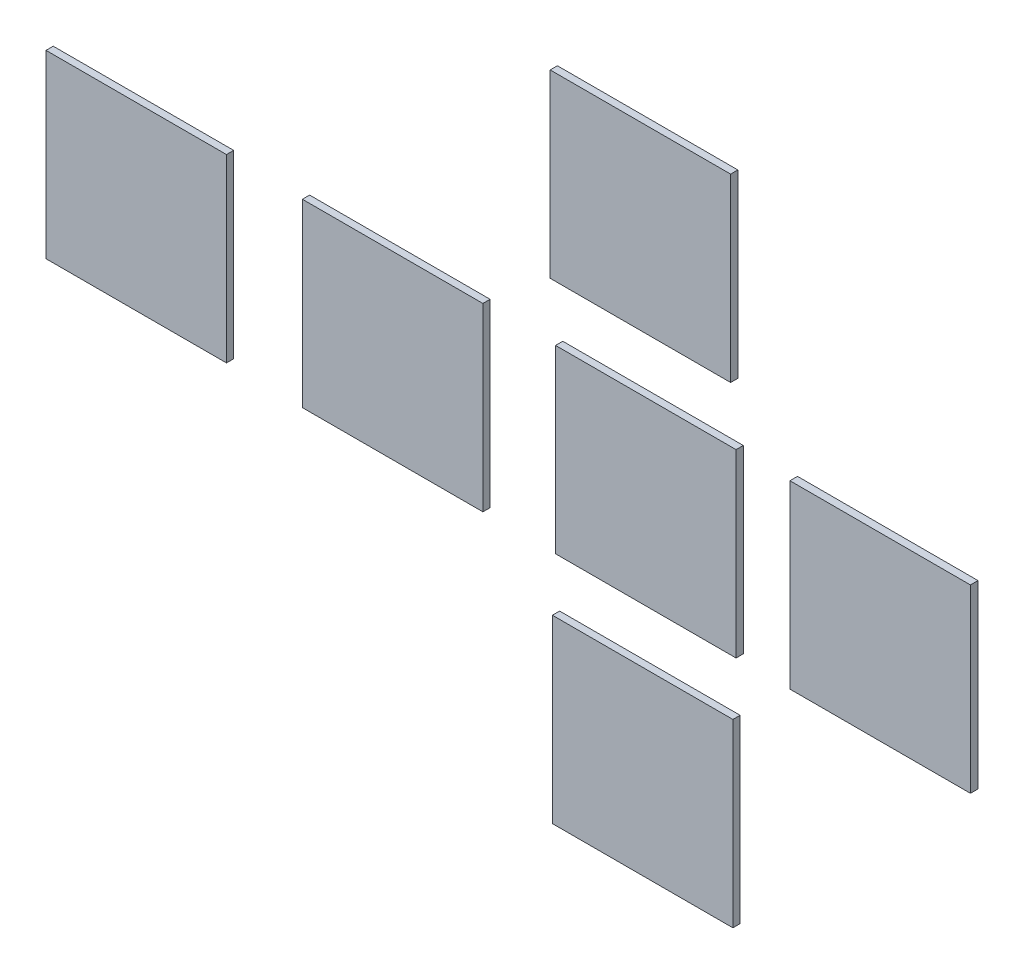
ISO-10303-21;
HEADER;
FILE_DESCRIPTION(('STEP AP214'),'2;1');
FILE_NAME('part.step','',(''),(''),'','','');
FILE_SCHEMA(('AUTOMOTIVE_DESIGN { 1 0 10303 214 1 1 1 1 }'));
ENDSEC;
DATA;
#1=APPLICATION_CONTEXT('core data for automotive mechanical design processes');
#2=APPLICATION_PROTOCOL_DEFINITION('international standard','automotive_design',2000,#1);
#3=PRODUCT_CONTEXT('',#1,'mechanical');
#4=PRODUCT('Part','Part','',(#3));
#5=PRODUCT_RELATED_PRODUCT_CATEGORY('part','',(#4));
#6=PRODUCT_DEFINITION_FORMATION('','',#4);
#7=PRODUCT_DEFINITION_CONTEXT('part definition',#1,'design');
#8=PRODUCT_DEFINITION('design','',#6,#7);
#9=PRODUCT_DEFINITION_SHAPE('','',#8);
#10=(LENGTH_UNIT() NAMED_UNIT(*) SI_UNIT(.MILLI.,.METRE.));
#11=(NAMED_UNIT(*) PLANE_ANGLE_UNIT() SI_UNIT($,.RADIAN.));
#12=(NAMED_UNIT(*) SI_UNIT($,.STERADIAN.) SOLID_ANGLE_UNIT());
#13=UNCERTAINTY_MEASURE_WITH_UNIT(LENGTH_MEASURE(1.E-05),#10,'distance_accuracy_value','');
#14=(GEOMETRIC_REPRESENTATION_CONTEXT(3) GLOBAL_UNCERTAINTY_ASSIGNED_CONTEXT((#13)) GLOBAL_UNIT_ASSIGNED_CONTEXT((#10,
#11,#12)) REPRESENTATION_CONTEXT('',''));
#15=CARTESIAN_POINT('',(0.,0.,0.));
#16=DIRECTION('',(0.,0.,1.));
#17=DIRECTION('',(1.,0.,0.));
#18=AXIS2_PLACEMENT_3D('',#15,#16,#17);
#19=CARTESIAN_POINT('',(-908.036665944506,-901.704073477175,20.));
#20=DIRECTION('',(-1.,0.,0.));
#21=DIRECTION('',(0.,0.,1.));
#22=AXIS2_PLACEMENT_3D('',#19,#20,#21);
#23=PLANE('',#22);
#24=DIRECTION('',(0.,1.,0.));
#25=VECTOR('',#24,1.);
#26=CARTESIAN_POINT('',(-908.036665944506,-901.704073477175,0.));
#27=LINE('',#26,#25);
#28=CARTESIAN_POINT('',(-908.036665944506,-901.704073477175,0.));
#29=VERTEX_POINT('',#28);
#30=CARTESIAN_POINT('',(-908.036665944506,-401.704073477175,0.));
#31=VERTEX_POINT('',#30);
#32=EDGE_CURVE('E12',#29,#31,#27,.T.);
#33=ORIENTED_EDGE('',*,*,#32,.F.);
#34=DIRECTION('',(0.,0.,-1.));
#35=VECTOR('',#34,1.);
#36=CARTESIAN_POINT('',(-908.036665944506,-901.704073477175,20.));
#37=LINE('',#36,#35);
#38=CARTESIAN_POINT('',(-908.036665944506,-901.704073477175,20.));
#39=VERTEX_POINT('',#38);
#40=EDGE_CURVE('E95',#39,#29,#37,.T.);
#41=ORIENTED_EDGE('',*,*,#40,.F.);
#42=DIRECTION('',(0.,1.,0.));
#43=VECTOR('',#42,1.);
#44=CARTESIAN_POINT('',(-908.036665944506,-901.704073477175,20.));
#45=LINE('',#44,#43);
#46=CARTESIAN_POINT('',(-908.036665944506,-401.704073477175,20.));
#47=VERTEX_POINT('',#46);
#48=EDGE_CURVE('E53',#39,#47,#45,.T.);
#49=ORIENTED_EDGE('',*,*,#48,.T.);
#50=DIRECTION('',(0.,0.,-1.));
#51=VECTOR('',#50,1.);
#52=CARTESIAN_POINT('',(-908.036665944506,-401.704073477175,20.));
#53=LINE('',#52,#51);
#54=EDGE_CURVE('E68',#47,#31,#53,.T.);
#55=ORIENTED_EDGE('',*,*,#54,.T.);
#56=EDGE_LOOP('',(#33,#41,#49,#55));
#57=FACE_BOUND('',#56,.T.);
#58=ADVANCED_FACE('F49',(#57),#23,.T.);
#59=CARTESIAN_POINT('',(-908.036665944506,-901.704073477175,20.));
#60=DIRECTION('',(0.,1.,0.));
#61=DIRECTION('',(0.,0.,1.));
#62=AXIS2_PLACEMENT_3D('',#59,#60,#61);
#63=PLANE('',#62);
#64=DIRECTION('',(1.,0.,0.));
#65=VECTOR('',#64,1.);
#66=CARTESIAN_POINT('',(-908.036665944506,-901.704073477175,0.));
#67=LINE('',#66,#65);
#68=CARTESIAN_POINT('',(-408.036665944506,-901.704073477175,0.));
#69=VERTEX_POINT('',#68);
#70=EDGE_CURVE('E98',#29,#69,#67,.T.);
#71=ORIENTED_EDGE('',*,*,#70,.T.);
#72=DIRECTION('',(0.,0.,-1.));
#73=VECTOR('',#72,1.);
#74=CARTESIAN_POINT('',(-408.036665944506,-901.704073477175,20.));
#75=LINE('',#74,#73);
#76=CARTESIAN_POINT('',(-408.036665944506,-901.704073477175,20.));
#77=VERTEX_POINT('',#76);
#78=EDGE_CURVE('E101',#77,#69,#75,.T.);
#79=ORIENTED_EDGE('',*,*,#78,.F.);
#80=DIRECTION('',(1.,0.,0.));
#81=VECTOR('',#80,1.);
#82=CARTESIAN_POINT('',(-908.036665944506,-901.704073477175,20.));
#83=LINE('',#82,#81);
#84=EDGE_CURVE('E117',#39,#77,#83,.T.);
#85=ORIENTED_EDGE('',*,*,#84,.F.);
#86=ORIENTED_EDGE('',*,*,#40,.T.);
#87=EDGE_LOOP('',(#71,#79,#85,#86));
#88=FACE_BOUND('',#87,.T.);
#89=ADVANCED_FACE('F100',(#88),#63,.F.);
#90=CARTESIAN_POINT('',(-408.036665944506,-901.704073477175,20.));
#91=DIRECTION('',(-1.,0.,0.));
#92=DIRECTION('',(0.,0.,1.));
#93=AXIS2_PLACEMENT_3D('',#90,#91,#92);
#94=PLANE('',#93);
#95=DIRECTION('',(0.,1.,0.));
#96=VECTOR('',#95,1.);
#97=CARTESIAN_POINT('',(-408.036665944506,-901.704073477175,0.));
#98=LINE('',#97,#96);
#99=CARTESIAN_POINT('',(-408.036665944506,-401.704073477175,0.));
#100=VERTEX_POINT('',#99);
#101=EDGE_CURVE('E104',#69,#100,#98,.T.);
#102=ORIENTED_EDGE('',*,*,#101,.T.);
#103=DIRECTION('',(0.,0.,-1.));
#104=VECTOR('',#103,1.);
#105=CARTESIAN_POINT('',(-408.036665944506,-401.704073477175,20.));
#106=LINE('',#105,#104);
#107=CARTESIAN_POINT('',(-408.036665944506,-401.704073477175,20.));
#108=VERTEX_POINT('',#107);
#109=EDGE_CURVE('E110',#108,#100,#106,.T.);
#110=ORIENTED_EDGE('',*,*,#109,.F.);
#111=DIRECTION('',(0.,1.,0.));
#112=VECTOR('',#111,1.);
#113=CARTESIAN_POINT('',(-408.036665944506,-901.704073477175,20.));
#114=LINE('',#113,#112);
#115=EDGE_CURVE('E85',#77,#108,#114,.T.);
#116=ORIENTED_EDGE('',*,*,#115,.F.);
#117=ORIENTED_EDGE('',*,*,#78,.T.);
#118=EDGE_LOOP('',(#102,#110,#116,#117));
#119=FACE_BOUND('',#118,.T.);
#120=ADVANCED_FACE('F108',(#119),#94,.F.);
#121=CARTESIAN_POINT('',(-908.036665944506,-401.704073477175,20.));
#122=DIRECTION('',(0.,1.,0.));
#123=DIRECTION('',(0.,0.,1.));
#124=AXIS2_PLACEMENT_3D('',#121,#122,#123);
#125=PLANE('',#124);
#126=DIRECTION('',(1.,0.,0.));
#127=VECTOR('',#126,1.);
#128=CARTESIAN_POINT('',(-908.036665944506,-401.704073477175,0.));
#129=LINE('',#128,#127);
#130=EDGE_CURVE('E59',#31,#100,#129,.T.);
#131=ORIENTED_EDGE('',*,*,#130,.F.);
#132=ORIENTED_EDGE('',*,*,#54,.F.);
#133=DIRECTION('',(1.,0.,0.));
#134=VECTOR('',#133,1.);
#135=CARTESIAN_POINT('',(-908.036665944506,-401.704073477175,20.));
#136=LINE('',#135,#134);
#137=EDGE_CURVE('E119',#47,#108,#136,.T.);
#138=ORIENTED_EDGE('',*,*,#137,.T.);
#139=ORIENTED_EDGE('',*,*,#109,.T.);
#140=EDGE_LOOP('',(#131,#132,#138,#139));
#141=FACE_BOUND('',#140,.T.);
#142=ADVANCED_FACE('F122',(#141),#125,.T.);
#143=CARTESIAN_POINT('',(0.,0.,20.));
#144=DIRECTION('',(0.,0.,-1.));
#145=DIRECTION('',(-1.,0.,0.));
#146=AXIS2_PLACEMENT_3D('',#143,#144,#145);
#147=PLANE('',#146);
#148=ORIENTED_EDGE('',*,*,#48,.F.);
#149=ORIENTED_EDGE('',*,*,#84,.T.);
#150=ORIENTED_EDGE('',*,*,#115,.T.);
#151=ORIENTED_EDGE('',*,*,#137,.F.);
#152=EDGE_LOOP('',(#148,#149,#150,#151));
#153=FACE_BOUND('',#152,.T.);
#154=ADVANCED_FACE('F51',(#153),#147,.F.);
#155=CARTESIAN_POINT('',(0.,0.,0.));
#156=DIRECTION('',(0.,0.,-1.));
#157=DIRECTION('',(-1.,0.,0.));
#158=AXIS2_PLACEMENT_3D('',#155,#156,#157);
#159=PLANE('',#158);
#160=ORIENTED_EDGE('',*,*,#32,.T.);
#161=ORIENTED_EDGE('',*,*,#130,.T.);
#162=ORIENTED_EDGE('',*,*,#101,.F.);
#163=ORIENTED_EDGE('',*,*,#70,.F.);
#164=EDGE_LOOP('',(#160,#161,#162,#163));
#165=FACE_BOUND('',#164,.T.);
#166=ADVANCED_FACE('F112',(#165),#159,.T.);
#167=CLOSED_SHELL('',(#58,#89,#120,#142,#154,#166));
#168=MANIFOLD_SOLID_BREP('B2',#167);
#169=CARTESIAN_POINT('',(-1600.64717586164,250.02016349866,20.));
#170=DIRECTION('',(0.,1.,0.));
#171=DIRECTION('',(0.,0.,1.));
#172=AXIS2_PLACEMENT_3D('',#169,#170,#171);
#173=PLANE('',#172);
#174=DIRECTION('',(1.,0.,0.));
#175=VECTOR('',#174,1.);
#176=CARTESIAN_POINT('',(-1600.64717586164,250.02016349866,0.));
#177=LINE('',#176,#175);
#178=CARTESIAN_POINT('',(-1600.64717586164,250.02016349866,0.));
#179=VERTEX_POINT('',#178);
#180=CARTESIAN_POINT('',(-1100.64717586164,250.02016349866,0.));
#181=VERTEX_POINT('',#180);
#182=EDGE_CURVE('E47',#179,#181,#177,.T.);
#183=ORIENTED_EDGE('',*,*,#182,.F.);
#184=DIRECTION('',(0.,0.,-1.));
#185=VECTOR('',#184,1.);
#186=CARTESIAN_POINT('',(-1600.64717586164,250.02016349866,20.));
#187=LINE('',#186,#185);
#188=CARTESIAN_POINT('',(-1600.64717586164,250.02016349866,20.));
#189=VERTEX_POINT('',#188);
#190=EDGE_CURVE('E230',#189,#179,#187,.T.);
#191=ORIENTED_EDGE('',*,*,#190,.F.);
#192=DIRECTION('',(1.,0.,0.));
#193=VECTOR('',#192,1.);
#194=CARTESIAN_POINT('',(-1600.64717586164,250.02016349866,20.));
#195=LINE('',#194,#193);
#196=CARTESIAN_POINT('',(-1100.64717586164,250.02016349866,20.));
#197=VERTEX_POINT('',#196);
#198=EDGE_CURVE('E186',#189,#197,#195,.T.);
#199=ORIENTED_EDGE('',*,*,#198,.T.);
#200=DIRECTION('',(0.,0.,-1.));
#201=VECTOR('',#200,1.);
#202=CARTESIAN_POINT('',(-1100.64717586164,250.02016349866,20.));
#203=LINE('',#202,#201);
#204=EDGE_CURVE('E201',#197,#181,#203,.T.);
#205=ORIENTED_EDGE('',*,*,#204,.T.);
#206=EDGE_LOOP('',(#183,#191,#199,#205));
#207=FACE_BOUND('',#206,.T.);
#208=ADVANCED_FACE('F182',(#207),#173,.T.);
#209=CARTESIAN_POINT('',(-1600.64717586164,-249.97983650134,20.));
#210=DIRECTION('',(-1.,0.,0.));
#211=DIRECTION('',(0.,0.,1.));
#212=AXIS2_PLACEMENT_3D('',#209,#210,#211);
#213=PLANE('',#212);
#214=DIRECTION('',(0.,1.,0.));
#215=VECTOR('',#214,1.);
#216=CARTESIAN_POINT('',(-1600.64717586164,-249.97983650134,0.));
#217=LINE('',#216,#215);
#218=CARTESIAN_POINT('',(-1600.64717586164,-249.97983650134,0.));
#219=VERTEX_POINT('',#218);
#220=EDGE_CURVE('E244',#219,#179,#217,.T.);
#221=ORIENTED_EDGE('',*,*,#220,.F.);
#222=DIRECTION('',(0.,0.,-1.));
#223=VECTOR('',#222,1.);
#224=CARTESIAN_POINT('',(-1600.64717586164,-249.97983650134,20.));
#225=LINE('',#224,#223);
#226=CARTESIAN_POINT('',(-1600.64717586164,-249.97983650134,20.));
#227=VERTEX_POINT('',#226);
#228=EDGE_CURVE('E233',#227,#219,#225,.T.);
#229=ORIENTED_EDGE('',*,*,#228,.F.);
#230=DIRECTION('',(0.,1.,0.));
#231=VECTOR('',#230,1.);
#232=CARTESIAN_POINT('',(-1600.64717586164,-249.97983650134,20.));
#233=LINE('',#232,#231);
#234=EDGE_CURVE('E251',#227,#189,#233,.T.);
#235=ORIENTED_EDGE('',*,*,#234,.T.);
#236=ORIENTED_EDGE('',*,*,#190,.T.);
#237=EDGE_LOOP('',(#221,#229,#235,#236));
#238=FACE_BOUND('',#237,.T.);
#239=ADVANCED_FACE('F246',(#238),#213,.T.);
#240=CARTESIAN_POINT('',(-1600.64717586164,-249.97983650134,20.));
#241=DIRECTION('',(0.,1.,0.));
#242=DIRECTION('',(0.,0.,1.));
#243=AXIS2_PLACEMENT_3D('',#240,#241,#242);
#244=PLANE('',#243);
#245=DIRECTION('',(1.,0.,0.));
#246=VECTOR('',#245,1.);
#247=CARTESIAN_POINT('',(-1600.64717586164,-249.97983650134,0.));
#248=LINE('',#247,#246);
#249=CARTESIAN_POINT('',(-1100.64717586164,-249.97983650134,0.));
#250=VERTEX_POINT('',#249);
#251=EDGE_CURVE('E236',#219,#250,#248,.T.);
#252=ORIENTED_EDGE('',*,*,#251,.T.);
#253=DIRECTION('',(0.,0.,-1.));
#254=VECTOR('',#253,1.);
#255=CARTESIAN_POINT('',(-1100.64717586164,-249.97983650134,20.));
#256=LINE('',#255,#254);
#257=CARTESIAN_POINT('',(-1100.64717586164,-249.97983650134,20.));
#258=VERTEX_POINT('',#257);
#259=EDGE_CURVE('E238',#258,#250,#256,.T.);
#260=ORIENTED_EDGE('',*,*,#259,.F.);
#261=DIRECTION('',(1.,0.,0.));
#262=VECTOR('',#261,1.);
#263=CARTESIAN_POINT('',(-1600.64717586164,-249.97983650134,20.));
#264=LINE('',#263,#262);
#265=EDGE_CURVE('E219',#227,#258,#264,.T.);
#266=ORIENTED_EDGE('',*,*,#265,.F.);
#267=ORIENTED_EDGE('',*,*,#228,.T.);
#268=EDGE_LOOP('',(#252,#260,#266,#267));
#269=FACE_BOUND('',#268,.T.);
#270=ADVANCED_FACE('F235',(#269),#244,.F.);
#271=CARTESIAN_POINT('',(-1100.64717586164,-249.97983650134,20.));
#272=DIRECTION('',(-1.,0.,0.));
#273=DIRECTION('',(0.,0.,1.));
#274=AXIS2_PLACEMENT_3D('',#271,#272,#273);
#275=PLANE('',#274);
#276=DIRECTION('',(0.,1.,0.));
#277=VECTOR('',#276,1.);
#278=CARTESIAN_POINT('',(-1100.64717586164,-249.97983650134,0.));
#279=LINE('',#278,#277);
#280=EDGE_CURVE('E192',#250,#181,#279,.T.);
#281=ORIENTED_EDGE('',*,*,#280,.T.);
#282=ORIENTED_EDGE('',*,*,#204,.F.);
#283=DIRECTION('',(0.,1.,0.));
#284=VECTOR('',#283,1.);
#285=CARTESIAN_POINT('',(-1100.64717586164,-249.97983650134,20.));
#286=LINE('',#285,#284);
#287=EDGE_CURVE('E224',#258,#197,#286,.T.);
#288=ORIENTED_EDGE('',*,*,#287,.F.);
#289=ORIENTED_EDGE('',*,*,#259,.T.);
#290=EDGE_LOOP('',(#281,#282,#288,#289));
#291=FACE_BOUND('',#290,.T.);
#292=ADVANCED_FACE('F256',(#291),#275,.F.);
#293=CARTESIAN_POINT('',(0.,0.,20.));
#294=DIRECTION('',(0.,0.,1.));
#295=DIRECTION('',(1.,0.,0.));
#296=AXIS2_PLACEMENT_3D('',#293,#294,#295);
#297=PLANE('',#296);
#298=ORIENTED_EDGE('',*,*,#198,.F.);
#299=ORIENTED_EDGE('',*,*,#234,.F.);
#300=ORIENTED_EDGE('',*,*,#265,.T.);
#301=ORIENTED_EDGE('',*,*,#287,.T.);
#302=EDGE_LOOP('',(#298,#299,#300,#301));
#303=FACE_BOUND('',#302,.T.);
#304=ADVANCED_FACE('F184',(#303),#297,.T.);
#305=CARTESIAN_POINT('',(0.,0.,0.));
#306=DIRECTION('',(0.,0.,1.));
#307=DIRECTION('',(1.,0.,0.));
#308=AXIS2_PLACEMENT_3D('',#305,#306,#307);
#309=PLANE('',#308);
#310=ORIENTED_EDGE('',*,*,#182,.T.);
#311=ORIENTED_EDGE('',*,*,#280,.F.);
#312=ORIENTED_EDGE('',*,*,#251,.F.);
#313=ORIENTED_EDGE('',*,*,#220,.T.);
#314=EDGE_LOOP('',(#310,#311,#312,#313));
#315=FACE_BOUND('',#314,.T.);
#316=ADVANCED_FACE('F243',(#315),#309,.F.);
#317=CLOSED_SHELL('',(#208,#239,#270,#292,#304,#316));
#318=MANIFOLD_SOLID_BREP('B6',#317);
#319=CARTESIAN_POINT('',(-2310.99861055703,-247.902571651521,20.));
#320=DIRECTION('',(-1.,0.,0.));
#321=DIRECTION('',(0.,0.,1.));
#322=AXIS2_PLACEMENT_3D('',#319,#320,#321);
#323=PLANE('',#322);
#324=DIRECTION('',(0.,1.,0.));
#325=VECTOR('',#324,1.);
#326=CARTESIAN_POINT('',(-2310.99861055703,-247.902571651521,0.));
#327=LINE('',#326,#325);
#328=CARTESIAN_POINT('',(-2310.99861055703,-247.902571651521,0.));
#329=VERTEX_POINT('',#328);
#330=CARTESIAN_POINT('',(-2310.99861055703,252.097428348479,0.));
#331=VERTEX_POINT('',#330);
#332=EDGE_CURVE('E180',#329,#331,#327,.T.);
#333=ORIENTED_EDGE('',*,*,#332,.F.);
#334=DIRECTION('',(0.,0.,-1.));
#335=VECTOR('',#334,1.);
#336=CARTESIAN_POINT('',(-2310.99861055703,-247.902571651521,20.));
#337=LINE('',#336,#335);
#338=CARTESIAN_POINT('',(-2310.99861055703,-247.902571651521,20.));
#339=VERTEX_POINT('',#338);
#340=EDGE_CURVE('E361',#339,#329,#337,.T.);
#341=ORIENTED_EDGE('',*,*,#340,.F.);
#342=DIRECTION('',(0.,1.,0.));
#343=VECTOR('',#342,1.);
#344=CARTESIAN_POINT('',(-2310.99861055703,-247.902571651521,20.));
#345=LINE('',#344,#343);
#346=CARTESIAN_POINT('',(-2310.99861055703,252.097428348479,20.));
#347=VERTEX_POINT('',#346);
#348=EDGE_CURVE('E319',#339,#347,#345,.T.);
#349=ORIENTED_EDGE('',*,*,#348,.T.);
#350=DIRECTION('',(0.,0.,-1.));
#351=VECTOR('',#350,1.);
#352=CARTESIAN_POINT('',(-2310.99861055703,252.097428348479,20.));
#353=LINE('',#352,#351);
#354=EDGE_CURVE('E334',#347,#331,#353,.T.);
#355=ORIENTED_EDGE('',*,*,#354,.T.);
#356=EDGE_LOOP('',(#333,#341,#349,#355));
#357=FACE_BOUND('',#356,.T.);
#358=ADVANCED_FACE('F315',(#357),#323,.T.);
#359=CARTESIAN_POINT('',(-2310.99861055703,-247.902571651521,20.));
#360=DIRECTION('',(0.,1.,0.));
#361=DIRECTION('',(0.,0.,1.));
#362=AXIS2_PLACEMENT_3D('',#359,#360,#361);
#363=PLANE('',#362);
#364=DIRECTION('',(1.,0.,0.));
#365=VECTOR('',#364,1.);
#366=CARTESIAN_POINT('',(-2310.99861055703,-247.902571651521,0.));
#367=LINE('',#366,#365);
#368=CARTESIAN_POINT('',(-1810.99861055703,-247.902571651521,0.));
#369=VERTEX_POINT('',#368);
#370=EDGE_CURVE('E364',#329,#369,#367,.T.);
#371=ORIENTED_EDGE('',*,*,#370,.T.);
#372=DIRECTION('',(0.,0.,-1.));
#373=VECTOR('',#372,1.);
#374=CARTESIAN_POINT('',(-1810.99861055703,-247.902571651521,20.));
#375=LINE('',#374,#373);
#376=CARTESIAN_POINT('',(-1810.99861055703,-247.902571651521,20.));
#377=VERTEX_POINT('',#376);
#378=EDGE_CURVE('E367',#377,#369,#375,.T.);
#379=ORIENTED_EDGE('',*,*,#378,.F.);
#380=DIRECTION('',(1.,0.,0.));
#381=VECTOR('',#380,1.);
#382=CARTESIAN_POINT('',(-2310.99861055703,-247.902571651521,20.));
#383=LINE('',#382,#381);
#384=EDGE_CURVE('E383',#339,#377,#383,.T.);
#385=ORIENTED_EDGE('',*,*,#384,.F.);
#386=ORIENTED_EDGE('',*,*,#340,.T.);
#387=EDGE_LOOP('',(#371,#379,#385,#386));
#388=FACE_BOUND('',#387,.T.);
#389=ADVANCED_FACE('F366',(#388),#363,.F.);
#390=CARTESIAN_POINT('',(-1810.99861055703,-247.902571651521,20.));
#391=DIRECTION('',(-1.,0.,0.));
#392=DIRECTION('',(0.,0.,1.));
#393=AXIS2_PLACEMENT_3D('',#390,#391,#392);
#394=PLANE('',#393);
#395=DIRECTION('',(0.,1.,0.));
#396=VECTOR('',#395,1.);
#397=CARTESIAN_POINT('',(-1810.99861055703,-247.902571651521,0.));
#398=LINE('',#397,#396);
#399=CARTESIAN_POINT('',(-1810.99861055703,252.097428348479,0.));
#400=VERTEX_POINT('',#399);
#401=EDGE_CURVE('E370',#369,#400,#398,.T.);
#402=ORIENTED_EDGE('',*,*,#401,.T.);
#403=DIRECTION('',(0.,0.,-1.));
#404=VECTOR('',#403,1.);
#405=CARTESIAN_POINT('',(-1810.99861055703,252.097428348479,20.));
#406=LINE('',#405,#404);
#407=CARTESIAN_POINT('',(-1810.99861055703,252.097428348479,20.));
#408=VERTEX_POINT('',#407);
#409=EDGE_CURVE('E376',#408,#400,#406,.T.);
#410=ORIENTED_EDGE('',*,*,#409,.F.);
#411=DIRECTION('',(0.,1.,0.));
#412=VECTOR('',#411,1.);
#413=CARTESIAN_POINT('',(-1810.99861055703,-247.902571651521,20.));
#414=LINE('',#413,#412);
#415=EDGE_CURVE('E351',#377,#408,#414,.T.);
#416=ORIENTED_EDGE('',*,*,#415,.F.);
#417=ORIENTED_EDGE('',*,*,#378,.T.);
#418=EDGE_LOOP('',(#402,#410,#416,#417));
#419=FACE_BOUND('',#418,.T.);
#420=ADVANCED_FACE('F374',(#419),#394,.F.);
#421=CARTESIAN_POINT('',(-2310.99861055703,252.097428348479,20.));
#422=DIRECTION('',(0.,1.,0.));
#423=DIRECTION('',(0.,0.,1.));
#424=AXIS2_PLACEMENT_3D('',#421,#422,#423);
#425=PLANE('',#424);
#426=DIRECTION('',(1.,0.,0.));
#427=VECTOR('',#426,1.);
#428=CARTESIAN_POINT('',(-2310.99861055703,252.097428348479,0.));
#429=LINE('',#428,#427);
#430=EDGE_CURVE('E325',#331,#400,#429,.T.);
#431=ORIENTED_EDGE('',*,*,#430,.F.);
#432=ORIENTED_EDGE('',*,*,#354,.F.);
#433=DIRECTION('',(1.,0.,0.));
#434=VECTOR('',#433,1.);
#435=CARTESIAN_POINT('',(-2310.99861055703,252.097428348479,20.));
#436=LINE('',#435,#434);
#437=EDGE_CURVE('E385',#347,#408,#436,.T.);
#438=ORIENTED_EDGE('',*,*,#437,.T.);
#439=ORIENTED_EDGE('',*,*,#409,.T.);
#440=EDGE_LOOP('',(#431,#432,#438,#439));
#441=FACE_BOUND('',#440,.T.);
#442=ADVANCED_FACE('F388',(#441),#425,.T.);
#443=CARTESIAN_POINT('',(0.,0.,20.));
#444=DIRECTION('',(0.,0.,-1.));
#445=DIRECTION('',(-1.,0.,0.));
#446=AXIS2_PLACEMENT_3D('',#443,#444,#445);
#447=PLANE('',#446);
#448=ORIENTED_EDGE('',*,*,#348,.F.);
#449=ORIENTED_EDGE('',*,*,#384,.T.);
#450=ORIENTED_EDGE('',*,*,#415,.T.);
#451=ORIENTED_EDGE('',*,*,#437,.F.);
#452=EDGE_LOOP('',(#448,#449,#450,#451));
#453=FACE_BOUND('',#452,.T.);
#454=ADVANCED_FACE('F317',(#453),#447,.F.);
#455=CARTESIAN_POINT('',(0.,0.,0.));
#456=DIRECTION('',(0.,0.,-1.));
#457=DIRECTION('',(-1.,0.,0.));
#458=AXIS2_PLACEMENT_3D('',#455,#456,#457);
#459=PLANE('',#458);
#460=ORIENTED_EDGE('',*,*,#332,.T.);
#461=ORIENTED_EDGE('',*,*,#430,.T.);
#462=ORIENTED_EDGE('',*,*,#401,.F.);
#463=ORIENTED_EDGE('',*,*,#370,.F.);
#464=EDGE_LOOP('',(#460,#461,#462,#463));
#465=FACE_BOUND('',#464,.T.);
#466=ADVANCED_FACE('F378',(#465),#459,.T.);
#467=CLOSED_SHELL('',(#358,#389,#420,#442,#454,#466));
#468=MANIFOLD_SOLID_BREP('B41',#467);
#469=CARTESIAN_POINT('',(-914.251974106129,403.510640463879,20.));
#470=DIRECTION('',(-1.,0.,0.));
#471=DIRECTION('',(0.,0.,1.));
#472=AXIS2_PLACEMENT_3D('',#469,#470,#471);
#473=PLANE('',#472);
#474=DIRECTION('',(0.,1.,0.));
#475=VECTOR('',#474,1.);
#476=CARTESIAN_POINT('',(-914.251974106129,403.510640463879,0.));
#477=LINE('',#476,#475);
#478=CARTESIAN_POINT('',(-914.251974106129,403.510640463879,0.));
#479=VERTEX_POINT('',#478);
#480=CARTESIAN_POINT('',(-914.251974106129,903.510640463879,0.));
#481=VERTEX_POINT('',#480);
#482=EDGE_CURVE('E513',#479,#481,#477,.T.);
#483=ORIENTED_EDGE('',*,*,#482,.F.);
#484=DIRECTION('',(0.,0.,-1.));
#485=VECTOR('',#484,1.);
#486=CARTESIAN_POINT('',(-914.251974106129,403.510640463879,20.));
#487=LINE('',#486,#485);
#488=CARTESIAN_POINT('',(-914.251974106129,403.510640463879,20.));
#489=VERTEX_POINT('',#488);
#490=EDGE_CURVE('E313',#489,#479,#487,.T.);
#491=ORIENTED_EDGE('',*,*,#490,.F.);
#492=DIRECTION('',(0.,1.,0.));
#493=VECTOR('',#492,1.);
#494=CARTESIAN_POINT('',(-914.251974106129,403.510640463879,20.));
#495=LINE('',#494,#493);
#496=CARTESIAN_POINT('',(-914.251974106129,903.510640463879,20.));
#497=VERTEX_POINT('',#496);
#498=EDGE_CURVE('E508',#489,#497,#495,.T.);
#499=ORIENTED_EDGE('',*,*,#498,.T.);
#500=DIRECTION('',(0.,0.,-1.));
#501=VECTOR('',#500,1.);
#502=CARTESIAN_POINT('',(-914.251974106129,903.510640463879,20.));
#503=LINE('',#502,#501);
#504=EDGE_CURVE('E451',#497,#481,#503,.T.);
#505=ORIENTED_EDGE('',*,*,#504,.T.);
#506=EDGE_LOOP('',(#483,#491,#499,#505));
#507=FACE_BOUND('',#506,.T.);
#508=ADVANCED_FACE('F448',(#507),#473,.T.);
#509=CARTESIAN_POINT('',(-914.251974106129,403.510640463879,20.));
#510=DIRECTION('',(0.,1.,0.));
#511=DIRECTION('',(0.,0.,1.));
#512=AXIS2_PLACEMENT_3D('',#509,#510,#511);
#513=PLANE('',#512);
#514=DIRECTION('',(1.,0.,0.));
#515=VECTOR('',#514,1.);
#516=CARTESIAN_POINT('',(-914.251974106129,403.510640463879,0.));
#517=LINE('',#516,#515);
#518=CARTESIAN_POINT('',(-414.251974106129,403.510640463879,0.));
#519=VERTEX_POINT('',#518);
#520=EDGE_CURVE('E481',#479,#519,#517,.T.);
#521=ORIENTED_EDGE('',*,*,#520,.T.);
#522=DIRECTION('',(0.,0.,-1.));
#523=VECTOR('',#522,1.);
#524=CARTESIAN_POINT('',(-414.251974106129,403.510640463879,20.));
#525=LINE('',#524,#523);
#526=CARTESIAN_POINT('',(-414.251974106129,403.510640463879,20.));
#527=VERTEX_POINT('',#526);
#528=EDGE_CURVE('E457',#527,#519,#525,.T.);
#529=ORIENTED_EDGE('',*,*,#528,.F.);
#530=DIRECTION('',(1.,0.,0.));
#531=VECTOR('',#530,1.);
#532=CARTESIAN_POINT('',(-914.251974106129,403.510640463879,20.));
#533=LINE('',#532,#531);
#534=EDGE_CURVE('E498',#489,#527,#533,.T.);
#535=ORIENTED_EDGE('',*,*,#534,.F.);
#536=ORIENTED_EDGE('',*,*,#490,.T.);
#537=EDGE_LOOP('',(#521,#529,#535,#536));
#538=FACE_BOUND('',#537,.T.);
#539=ADVANCED_FACE('F523',(#538),#513,.F.);
#540=CARTESIAN_POINT('',(-414.251974106129,403.510640463879,20.));
#541=DIRECTION('',(-1.,0.,0.));
#542=DIRECTION('',(0.,0.,1.));
#543=AXIS2_PLACEMENT_3D('',#540,#541,#542);
#544=PLANE('',#543);
#545=DIRECTION('',(0.,1.,0.));
#546=VECTOR('',#545,1.);
#547=CARTESIAN_POINT('',(-414.251974106129,403.510640463879,0.));
#548=LINE('',#547,#546);
#549=CARTESIAN_POINT('',(-414.251974106129,903.510640463879,0.));
#550=VERTEX_POINT('',#549);
#551=EDGE_CURVE('E505',#519,#550,#548,.T.);
#552=ORIENTED_EDGE('',*,*,#551,.T.);
#553=DIRECTION('',(0.,0.,-1.));
#554=VECTOR('',#553,1.);
#555=CARTESIAN_POINT('',(-414.251974106129,903.510640463879,20.));
#556=LINE('',#555,#554);
#557=CARTESIAN_POINT('',(-414.251974106129,903.510640463879,20.));
#558=VERTEX_POINT('',#557);
#559=EDGE_CURVE('E502',#558,#550,#556,.T.);
#560=ORIENTED_EDGE('',*,*,#559,.F.);
#561=DIRECTION('',(0.,1.,0.));
#562=VECTOR('',#561,1.);
#563=CARTESIAN_POINT('',(-414.251974106129,403.510640463879,20.));
#564=LINE('',#563,#562);
#565=EDGE_CURVE('E493',#527,#558,#564,.T.);
#566=ORIENTED_EDGE('',*,*,#565,.F.);
#567=ORIENTED_EDGE('',*,*,#528,.T.);
#568=EDGE_LOOP('',(#552,#560,#566,#567));
#569=FACE_BOUND('',#568,.T.);
#570=ADVANCED_FACE('F503',(#569),#544,.F.);
#571=CARTESIAN_POINT('',(-914.251974106129,903.510640463879,20.));
#572=DIRECTION('',(0.,1.,0.));
#573=DIRECTION('',(0.,0.,1.));
#574=AXIS2_PLACEMENT_3D('',#571,#572,#573);
#575=PLANE('',#574);
#576=DIRECTION('',(1.,0.,0.));
#577=VECTOR('',#576,1.);
#578=CARTESIAN_POINT('',(-914.251974106129,903.510640463879,0.));
#579=LINE('',#578,#577);
#580=EDGE_CURVE('E516',#481,#550,#579,.T.);
#581=ORIENTED_EDGE('',*,*,#580,.F.);
#582=ORIENTED_EDGE('',*,*,#504,.F.);
#583=DIRECTION('',(1.,0.,0.));
#584=VECTOR('',#583,1.);
#585=CARTESIAN_POINT('',(-914.251974106129,903.510640463879,20.));
#586=LINE('',#585,#584);
#587=EDGE_CURVE('E497',#497,#558,#586,.T.);
#588=ORIENTED_EDGE('',*,*,#587,.T.);
#589=ORIENTED_EDGE('',*,*,#559,.T.);
#590=EDGE_LOOP('',(#581,#582,#588,#589));
#591=FACE_BOUND('',#590,.T.);
#592=ADVANCED_FACE('F507',(#591),#575,.T.);
#593=CARTESIAN_POINT('',(0.,0.,20.));
#594=DIRECTION('',(0.,0.,-1.));
#595=DIRECTION('',(-1.,0.,0.));
#596=AXIS2_PLACEMENT_3D('',#593,#594,#595);
#597=PLANE('',#596);
#598=ORIENTED_EDGE('',*,*,#498,.F.);
#599=ORIENTED_EDGE('',*,*,#534,.T.);
#600=ORIENTED_EDGE('',*,*,#565,.T.);
#601=ORIENTED_EDGE('',*,*,#587,.F.);
#602=EDGE_LOOP('',(#598,#599,#600,#601));
#603=FACE_BOUND('',#602,.T.);
#604=ADVANCED_FACE('F496',(#603),#597,.F.);
#605=CARTESIAN_POINT('',(0.,0.,0.));
#606=DIRECTION('',(0.,0.,-1.));
#607=DIRECTION('',(-1.,0.,0.));
#608=AXIS2_PLACEMENT_3D('',#605,#606,#607);
#609=PLANE('',#608);
#610=ORIENTED_EDGE('',*,*,#482,.T.);
#611=ORIENTED_EDGE('',*,*,#580,.T.);
#612=ORIENTED_EDGE('',*,*,#551,.F.);
#613=ORIENTED_EDGE('',*,*,#520,.F.);
#614=EDGE_LOOP('',(#610,#611,#612,#613));
#615=FACE_BOUND('',#614,.T.);
#616=ADVANCED_FACE('F521',(#615),#609,.T.);
#617=CLOSED_SHELL('',(#508,#539,#570,#592,#604,#616));
#618=MANIFOLD_SOLID_BREP('B174',#617);
#619=CARTESIAN_POINT('',(-899.260038846539,250.,20.));
#620=DIRECTION('',(0.,1.,0.));
#621=DIRECTION('',(0.,0.,1.));
#622=AXIS2_PLACEMENT_3D('',#619,#620,#621);
#623=PLANE('',#622);
#624=DIRECTION('',(1.,0.,0.));
#625=VECTOR('',#624,1.);
#626=CARTESIAN_POINT('',(-899.260038846539,250.,0.));
#627=LINE('',#626,#625);
#628=CARTESIAN_POINT('',(-899.260038846539,250.,0.));
#629=VERTEX_POINT('',#628);
#630=CARTESIAN_POINT('',(-399.260038846539,250.,0.));
#631=VERTEX_POINT('',#630);
#632=EDGE_CURVE('E646',#629,#631,#627,.T.);
#633=ORIENTED_EDGE('',*,*,#632,.F.);
#634=DIRECTION('',(0.,0.,-1.));
#635=VECTOR('',#634,1.);
#636=CARTESIAN_POINT('',(-899.260038846539,250.,20.));
#637=LINE('',#636,#635);
#638=CARTESIAN_POINT('',(-899.260038846539,250.,20.));
#639=VERTEX_POINT('',#638);
#640=EDGE_CURVE('E446',#639,#629,#637,.T.);
#641=ORIENTED_EDGE('',*,*,#640,.F.);
#642=DIRECTION('',(1.,0.,0.));
#643=VECTOR('',#642,1.);
#644=CARTESIAN_POINT('',(-899.260038846539,250.,20.));
#645=LINE('',#644,#643);
#646=CARTESIAN_POINT('',(-399.260038846539,250.,20.));
#647=VERTEX_POINT('',#646);
#648=EDGE_CURVE('E640',#639,#647,#645,.T.);
#649=ORIENTED_EDGE('',*,*,#648,.T.);
#650=DIRECTION('',(0.,0.,-1.));
#651=VECTOR('',#650,1.);
#652=CARTESIAN_POINT('',(-399.260038846539,250.,20.));
#653=LINE('',#652,#651);
#654=EDGE_CURVE('E585',#647,#631,#653,.T.);
#655=ORIENTED_EDGE('',*,*,#654,.T.);
#656=EDGE_LOOP('',(#633,#641,#649,#655));
#657=FACE_BOUND('',#656,.T.);
#658=ADVANCED_FACE('F582',(#657),#623,.T.);
#659=CARTESIAN_POINT('',(-899.260038846539,-250.,20.));
#660=DIRECTION('',(-1.,0.,0.));
#661=DIRECTION('',(0.,0.,1.));
#662=AXIS2_PLACEMENT_3D('',#659,#660,#661);
#663=PLANE('',#662);
#664=DIRECTION('',(0.,1.,0.));
#665=VECTOR('',#664,1.);
#666=CARTESIAN_POINT('',(-899.260038846539,-250.,0.));
#667=LINE('',#666,#665);
#668=CARTESIAN_POINT('',(-899.260038846539,-250.,0.));
#669=VERTEX_POINT('',#668);
#670=EDGE_CURVE('E642',#669,#629,#667,.T.);
#671=ORIENTED_EDGE('',*,*,#670,.F.);
#672=DIRECTION('',(0.,0.,-1.));
#673=VECTOR('',#672,1.);
#674=CARTESIAN_POINT('',(-899.260038846539,-250.,20.));
#675=LINE('',#674,#673);
#676=CARTESIAN_POINT('',(-899.260038846539,-250.,20.));
#677=VERTEX_POINT('',#676);
#678=EDGE_CURVE('E591',#677,#669,#675,.T.);
#679=ORIENTED_EDGE('',*,*,#678,.F.);
#680=DIRECTION('',(0.,1.,0.));
#681=VECTOR('',#680,1.);
#682=CARTESIAN_POINT('',(-899.260038846539,-250.,20.));
#683=LINE('',#682,#681);
#684=EDGE_CURVE('E630',#677,#639,#683,.T.);
#685=ORIENTED_EDGE('',*,*,#684,.T.);
#686=ORIENTED_EDGE('',*,*,#640,.T.);
#687=EDGE_LOOP('',(#671,#679,#685,#686));
#688=FACE_BOUND('',#687,.T.);
#689=ADVANCED_FACE('F656',(#688),#663,.T.);
#690=CARTESIAN_POINT('',(-899.260038846539,-250.,20.));
#691=DIRECTION('',(0.,1.,0.));
#692=DIRECTION('',(0.,0.,1.));
#693=AXIS2_PLACEMENT_3D('',#690,#691,#692);
#694=PLANE('',#693);
#695=DIRECTION('',(1.,0.,0.));
#696=VECTOR('',#695,1.);
#697=CARTESIAN_POINT('',(-899.260038846539,-250.,0.));
#698=LINE('',#697,#696);
#699=CARTESIAN_POINT('',(-399.260038846539,-250.,0.));
#700=VERTEX_POINT('',#699);
#701=EDGE_CURVE('E635',#669,#700,#698,.T.);
#702=ORIENTED_EDGE('',*,*,#701,.T.);
#703=DIRECTION('',(0.,0.,-1.));
#704=VECTOR('',#703,1.);
#705=CARTESIAN_POINT('',(-399.260038846539,-250.,20.));
#706=LINE('',#705,#704);
#707=CARTESIAN_POINT('',(-399.260038846539,-250.,20.));
#708=VERTEX_POINT('',#707);
#709=EDGE_CURVE('E633',#708,#700,#706,.T.);
#710=ORIENTED_EDGE('',*,*,#709,.F.);
#711=DIRECTION('',(1.,0.,0.));
#712=VECTOR('',#711,1.);
#713=CARTESIAN_POINT('',(-899.260038846539,-250.,20.));
#714=LINE('',#713,#712);
#715=EDGE_CURVE('E627',#677,#708,#714,.T.);
#716=ORIENTED_EDGE('',*,*,#715,.F.);
#717=ORIENTED_EDGE('',*,*,#678,.T.);
#718=EDGE_LOOP('',(#702,#710,#716,#717));
#719=FACE_BOUND('',#718,.T.);
#720=ADVANCED_FACE('F634',(#719),#694,.F.);
#721=CARTESIAN_POINT('',(-399.260038846539,-250.,20.));
#722=DIRECTION('',(-1.,0.,0.));
#723=DIRECTION('',(0.,0.,1.));
#724=AXIS2_PLACEMENT_3D('',#721,#722,#723);
#725=PLANE('',#724);
#726=DIRECTION('',(0.,1.,0.));
#727=VECTOR('',#726,1.);
#728=CARTESIAN_POINT('',(-399.260038846539,-250.,0.));
#729=LINE('',#728,#727);
#730=EDGE_CURVE('E649',#700,#631,#729,.T.);
#731=ORIENTED_EDGE('',*,*,#730,.T.);
#732=ORIENTED_EDGE('',*,*,#654,.F.);
#733=DIRECTION('',(0.,1.,0.));
#734=VECTOR('',#733,1.);
#735=CARTESIAN_POINT('',(-399.260038846539,-250.,20.));
#736=LINE('',#735,#734);
#737=EDGE_CURVE('E624',#708,#647,#736,.T.);
#738=ORIENTED_EDGE('',*,*,#737,.F.);
#739=ORIENTED_EDGE('',*,*,#709,.T.);
#740=EDGE_LOOP('',(#731,#732,#738,#739));
#741=FACE_BOUND('',#740,.T.);
#742=ADVANCED_FACE('F639',(#741),#725,.F.);
#743=CARTESIAN_POINT('',(0.,0.,20.));
#744=DIRECTION('',(0.,0.,1.));
#745=DIRECTION('',(1.,0.,0.));
#746=AXIS2_PLACEMENT_3D('',#743,#744,#745);
#747=PLANE('',#746);
#748=ORIENTED_EDGE('',*,*,#648,.F.);
#749=ORIENTED_EDGE('',*,*,#684,.F.);
#750=ORIENTED_EDGE('',*,*,#715,.T.);
#751=ORIENTED_EDGE('',*,*,#737,.T.);
#752=EDGE_LOOP('',(#748,#749,#750,#751));
#753=FACE_BOUND('',#752,.T.);
#754=ADVANCED_FACE('F629',(#753),#747,.T.);
#755=CARTESIAN_POINT('',(0.,0.,0.));
#756=DIRECTION('',(0.,0.,1.));
#757=DIRECTION('',(1.,0.,0.));
#758=AXIS2_PLACEMENT_3D('',#755,#756,#757);
#759=PLANE('',#758);
#760=ORIENTED_EDGE('',*,*,#632,.T.);
#761=ORIENTED_EDGE('',*,*,#730,.F.);
#762=ORIENTED_EDGE('',*,*,#701,.F.);
#763=ORIENTED_EDGE('',*,*,#670,.T.);
#764=EDGE_LOOP('',(#760,#761,#762,#763));
#765=FACE_BOUND('',#764,.T.);
#766=ADVANCED_FACE('F655',(#765),#759,.F.);
#767=CLOSED_SHELL('',(#658,#689,#720,#742,#754,#766));
#768=MANIFOLD_SOLID_BREP('B307',#767);
#769=CARTESIAN_POINT('',(250.,250.,-1.));
#770=DIRECTION('',(0.,1.,0.));
#771=DIRECTION('',(-1.,0.,0.));
#772=AXIS2_PLACEMENT_3D('',#769,#770,#771);
#773=PLANE('',#772);
#774=DIRECTION('',(0.,0.,1.));
#775=VECTOR('',#774,1.);
#776=CARTESIAN_POINT('',(-250.,250.,-1.));
#777=LINE('',#776,#775);
#778=CARTESIAN_POINT('',(-250.,250.,-1.));
#779=VERTEX_POINT('',#778);
#780=CARTESIAN_POINT('',(-250.,250.,20.));
#781=VERTEX_POINT('',#780);
#782=EDGE_CURVE('E708',#779,#781,#777,.T.);
#783=ORIENTED_EDGE('',*,*,#782,.T.);
#784=DIRECTION('',(-1.,0.,0.));
#785=VECTOR('',#784,1.);
#786=CARTESIAN_POINT('',(250.,250.,20.));
#787=LINE('',#786,#785);
#788=CARTESIAN_POINT('',(250.,250.,20.));
#789=VERTEX_POINT('',#788);
#790=EDGE_CURVE('E745',#789,#781,#787,.T.);
#791=ORIENTED_EDGE('',*,*,#790,.F.);
#792=DIRECTION('',(0.,0.,1.));
#793=VECTOR('',#792,1.);
#794=CARTESIAN_POINT('',(250.,250.,-1.));
#795=LINE('',#794,#793);
#796=CARTESIAN_POINT('',(250.,250.,-1.));
#797=VERTEX_POINT('',#796);
#798=EDGE_CURVE('E580',#797,#789,#795,.T.);
#799=ORIENTED_EDGE('',*,*,#798,.F.);
#800=DIRECTION('',(-1.,0.,0.));
#801=VECTOR('',#800,1.);
#802=CARTESIAN_POINT('',(250.,250.,-1.));
#803=LINE('',#802,#801);
#804=EDGE_CURVE('E746',#797,#779,#803,.T.);
#805=ORIENTED_EDGE('',*,*,#804,.T.);
#806=EDGE_LOOP('',(#783,#791,#799,#805));
#807=FACE_BOUND('',#806,.T.);
#808=ADVANCED_FACE('F705',(#807),#773,.T.);
#809=CARTESIAN_POINT('',(250.,-250.,-1.));
#810=DIRECTION('',(1.,0.,0.));
#811=DIRECTION('',(0.,1.,0.));
#812=AXIS2_PLACEMENT_3D('',#809,#810,#811);
#813=PLANE('',#812);
#814=ORIENTED_EDGE('',*,*,#798,.T.);
#815=DIRECTION('',(0.,1.,0.));
#816=VECTOR('',#815,1.);
#817=CARTESIAN_POINT('',(250.,-250.,20.));
#818=LINE('',#817,#816);
#819=CARTESIAN_POINT('',(250.,-250.,20.));
#820=VERTEX_POINT('',#819);
#821=EDGE_CURVE('E759',#820,#789,#818,.T.);
#822=ORIENTED_EDGE('',*,*,#821,.F.);
#823=DIRECTION('',(0.,0.,1.));
#824=VECTOR('',#823,1.);
#825=CARTESIAN_POINT('',(250.,-250.,-1.));
#826=LINE('',#825,#824);
#827=CARTESIAN_POINT('',(250.,-250.,-1.));
#828=VERTEX_POINT('',#827);
#829=EDGE_CURVE('E713',#828,#820,#826,.T.);
#830=ORIENTED_EDGE('',*,*,#829,.F.);
#831=DIRECTION('',(0.,1.,0.));
#832=VECTOR('',#831,1.);
#833=CARTESIAN_POINT('',(250.,-250.,-1.));
#834=LINE('',#833,#832);
#835=EDGE_CURVE('E751',#828,#797,#834,.T.);
#836=ORIENTED_EDGE('',*,*,#835,.T.);
#837=EDGE_LOOP('',(#814,#822,#830,#836));
#838=FACE_BOUND('',#837,.T.);
#839=ADVANCED_FACE('F777',(#838),#813,.T.);
#840=CARTESIAN_POINT('',(250.,-250.,-1.));
#841=DIRECTION('',(0.,1.,0.));
#842=DIRECTION('',(-1.,0.,0.));
#843=AXIS2_PLACEMENT_3D('',#840,#841,#842);
#844=PLANE('',#843);
#845=ORIENTED_EDGE('',*,*,#829,.T.);
#846=DIRECTION('',(-1.,0.,0.));
#847=VECTOR('',#846,1.);
#848=CARTESIAN_POINT('',(250.,-250.,20.));
#849=LINE('',#848,#847);
#850=CARTESIAN_POINT('',(-250.,-250.,20.));
#851=VERTEX_POINT('',#850);
#852=EDGE_CURVE('E763',#820,#851,#849,.T.);
#853=ORIENTED_EDGE('',*,*,#852,.T.);
#854=DIRECTION('',(0.,0.,1.));
#855=VECTOR('',#854,1.);
#856=CARTESIAN_POINT('',(-250.,-250.,-1.));
#857=LINE('',#856,#855);
#858=CARTESIAN_POINT('',(-250.,-250.,-1.));
#859=VERTEX_POINT('',#858);
#860=EDGE_CURVE('E750',#859,#851,#857,.T.);
#861=ORIENTED_EDGE('',*,*,#860,.F.);
#862=DIRECTION('',(-1.,0.,0.));
#863=VECTOR('',#862,1.);
#864=CARTESIAN_POINT('',(250.,-250.,-1.));
#865=LINE('',#864,#863);
#866=EDGE_CURVE('E771',#828,#859,#865,.T.);
#867=ORIENTED_EDGE('',*,*,#866,.F.);
#868=EDGE_LOOP('',(#845,#853,#861,#867));
#869=FACE_BOUND('',#868,.T.);
#870=ADVANCED_FACE('F775',(#869),#844,.F.);
#871=CARTESIAN_POINT('',(-250.,-250.,-1.));
#872=DIRECTION('',(1.,0.,0.));
#873=DIRECTION('',(0.,0.,-1.));
#874=AXIS2_PLACEMENT_3D('',#871,#872,#873);
#875=PLANE('',#874);
#876=ORIENTED_EDGE('',*,*,#860,.T.);
#877=DIRECTION('',(0.,1.,0.));
#878=VECTOR('',#877,1.);
#879=CARTESIAN_POINT('',(-250.,-250.,20.));
#880=LINE('',#879,#878);
#881=EDGE_CURVE('E757',#851,#781,#880,.T.);
#882=ORIENTED_EDGE('',*,*,#881,.T.);
#883=ORIENTED_EDGE('',*,*,#782,.F.);
#884=DIRECTION('',(0.,1.,0.));
#885=VECTOR('',#884,1.);
#886=CARTESIAN_POINT('',(-250.,-250.,-1.));
#887=LINE('',#886,#885);
#888=EDGE_CURVE('E769',#859,#779,#887,.T.);
#889=ORIENTED_EDGE('',*,*,#888,.F.);
#890=EDGE_LOOP('',(#876,#882,#883,#889));
#891=FACE_BOUND('',#890,.T.);
#892=ADVANCED_FACE('F761',(#891),#875,.F.);
#893=CARTESIAN_POINT('',(0.,0.,-1.));
#894=DIRECTION('',(0.,0.,-1.));
#895=DIRECTION('',(-1.,0.,0.));
#896=AXIS2_PLACEMENT_3D('',#893,#894,#895);
#897=PLANE('',#896);
#898=ORIENTED_EDGE('',*,*,#804,.F.);
#899=ORIENTED_EDGE('',*,*,#835,.F.);
#900=ORIENTED_EDGE('',*,*,#866,.T.);
#901=ORIENTED_EDGE('',*,*,#888,.T.);
#902=EDGE_LOOP('',(#898,#899,#900,#901));
#903=FACE_BOUND('',#902,.T.);
#904=ADVANCED_FACE('F779',(#903),#897,.T.);
#905=CARTESIAN_POINT('',(0.,0.,20.));
#906=DIRECTION('',(0.,0.,-1.));
#907=DIRECTION('',(-1.,0.,0.));
#908=AXIS2_PLACEMENT_3D('',#905,#906,#907);
#909=PLANE('',#908);
#910=ORIENTED_EDGE('',*,*,#790,.T.);
#911=ORIENTED_EDGE('',*,*,#881,.F.);
#912=ORIENTED_EDGE('',*,*,#852,.F.);
#913=ORIENTED_EDGE('',*,*,#821,.T.);
#914=EDGE_LOOP('',(#910,#911,#912,#913));
#915=FACE_BOUND('',#914,.T.);
#916=ADVANCED_FACE('F755',(#915),#909,.F.);
#917=CLOSED_SHELL('',(#808,#839,#870,#892,#904,#916));
#918=MANIFOLD_SOLID_BREP('B440',#917);
#919=ADVANCED_BREP_SHAPE_REPRESENTATION('',(#18,#168,#318,#468,#618,#768,#918),#14);
#920=SHAPE_DEFINITION_REPRESENTATION(#9,#919);
ENDSEC;
END-ISO-10303-21;
